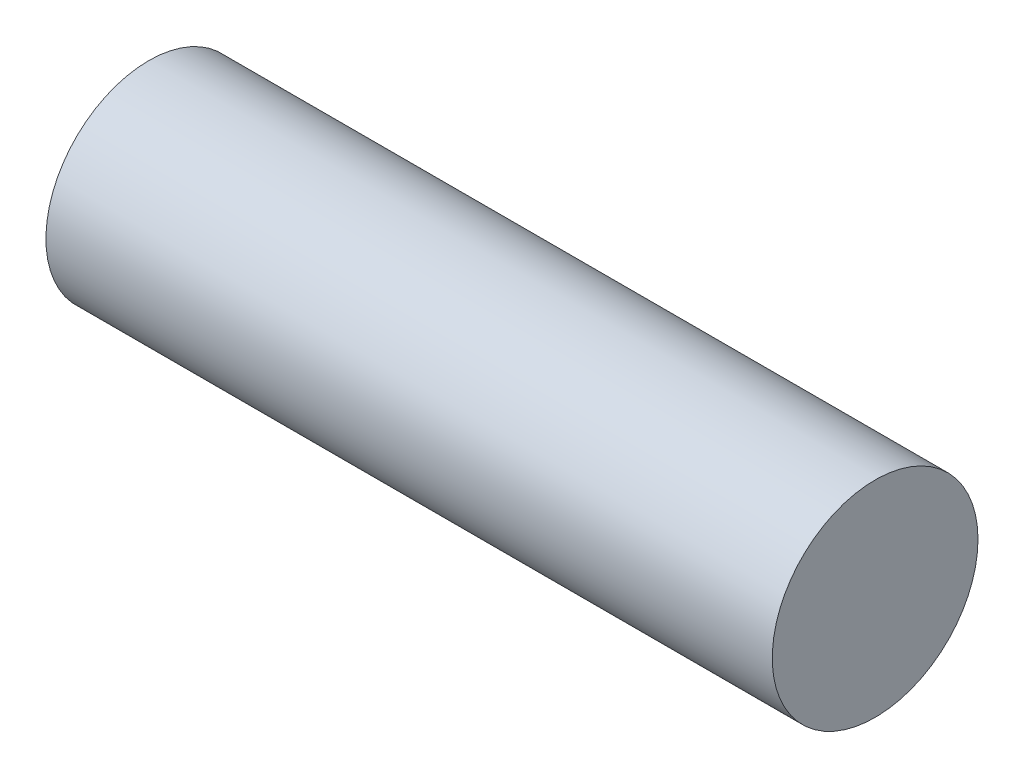
ISO-10303-21;
HEADER;
FILE_DESCRIPTION(('STEP AP214'),'2;1');
FILE_NAME('part.step','',(''),(''),'','','');
FILE_SCHEMA(('AUTOMOTIVE_DESIGN { 1 0 10303 214 1 1 1 1 }'));
ENDSEC;
DATA;
#1=APPLICATION_CONTEXT('core data for automotive mechanical design processes');
#2=APPLICATION_PROTOCOL_DEFINITION('international standard','automotive_design',2000,#1);
#3=PRODUCT_CONTEXT('',#1,'mechanical');
#4=PRODUCT('Part','Part','',(#3));
#5=PRODUCT_RELATED_PRODUCT_CATEGORY('part','',(#4));
#6=PRODUCT_DEFINITION_FORMATION('','',#4);
#7=PRODUCT_DEFINITION_CONTEXT('part definition',#1,'design');
#8=PRODUCT_DEFINITION('design','',#6,#7);
#9=PRODUCT_DEFINITION_SHAPE('','',#8);
#10=(LENGTH_UNIT() NAMED_UNIT(*) SI_UNIT(.MILLI.,.METRE.));
#11=(NAMED_UNIT(*) PLANE_ANGLE_UNIT() SI_UNIT($,.RADIAN.));
#12=(NAMED_UNIT(*) SI_UNIT($,.STERADIAN.) SOLID_ANGLE_UNIT());
#13=UNCERTAINTY_MEASURE_WITH_UNIT(LENGTH_MEASURE(1.E-05),#10,'distance_accuracy_value','');
#14=(GEOMETRIC_REPRESENTATION_CONTEXT(3) GLOBAL_UNCERTAINTY_ASSIGNED_CONTEXT((#13)) GLOBAL_UNIT_ASSIGNED_CONTEXT((#10,
#11,#12)) REPRESENTATION_CONTEXT('',''));
#15=CARTESIAN_POINT('',(0.,0.,0.));
#16=DIRECTION('',(0.,0.,1.));
#17=DIRECTION('',(1.,0.,0.));
#18=AXIS2_PLACEMENT_3D('',#15,#16,#17);
#19=CARTESIAN_POINT('',(0.,0.,0.));
#20=DIRECTION('',(1.,0.,0.));
#21=DIRECTION('',(0.,1.,0.));
#22=AXIS2_PLACEMENT_3D('',#19,#20,#21);
#23=SPHERICAL_SURFACE('',#22,1.65);
#24=CARTESIAN_POINT('',(0.,0.,0.));
#25=DIRECTION('',(1.,0.,0.));
#26=DIRECTION('',(0.,0.,-1.));
#27=AXIS2_PLACEMENT_3D('',#24,#25,#26);
#28=CIRCLE('',#27,1.65);
#29=CARTESIAN_POINT('',(0.,0.,-1.65));
#30=VERTEX_POINT('',#29);
#31=EDGE_CURVE('E37',#30,#30,#28,.T.);
#32=ORIENTED_EDGE('',*,*,#31,.F.);
#33=EDGE_LOOP('',(#32));
#34=FACE_BOUND('',#33,.T.);
#35=ADVANCED_FACE('F31',(#34),#23,.F.);
#36=CARTESIAN_POINT('',(11.65,1.65,0.));
#37=DIRECTION('',(1.,0.,0.));
#38=DIRECTION('',(0.,0.,-1.));
#39=AXIS2_PLACEMENT_3D('',#36,#37,#38);
#40=PLANE('',#39);
#41=CARTESIAN_POINT('',(11.65,0.,0.));
#42=DIRECTION('',(1.,0.,0.));
#43=DIRECTION('',(0.,0.,-1.));
#44=AXIS2_PLACEMENT_3D('',#41,#42,#43);
#45=CIRCLE('',#44,1.65);
#46=CARTESIAN_POINT('',(11.65,0.,-1.65));
#47=VERTEX_POINT('',#46);
#48=EDGE_CURVE('E10',#47,#47,#45,.T.);
#49=ORIENTED_EDGE('',*,*,#48,.T.);
#50=EDGE_LOOP('',(#49));
#51=FACE_BOUND('',#50,.T.);
#52=ADVANCED_FACE('F47',(#51),#40,.T.);
#53=CARTESIAN_POINT('',(11.65,0.,0.));
#54=DIRECTION('',(1.,0.,0.));
#55=DIRECTION('',(0.,0.,-1.));
#56=AXIS2_PLACEMENT_3D('',#53,#54,#55);
#57=CYLINDRICAL_SURFACE('',#56,1.65);
#58=ORIENTED_EDGE('',*,*,#31,.T.);
#59=EDGE_LOOP('',(#58));
#60=FACE_BOUND('',#59,.T.);
#61=ORIENTED_EDGE('',*,*,#48,.F.);
#62=EDGE_LOOP('',(#61));
#63=FACE_BOUND('',#62,.T.);
#64=ADVANCED_FACE('F43',(#60,#63),#57,.T.);
#65=CLOSED_SHELL('',(#35,#52,#64));
#66=MANIFOLD_SOLID_BREP('B2',#65);
#67=ADVANCED_BREP_SHAPE_REPRESENTATION('',(#18,#66),#14);
#68=SHAPE_DEFINITION_REPRESENTATION(#9,#67);
ENDSEC;
END-ISO-10303-21;
